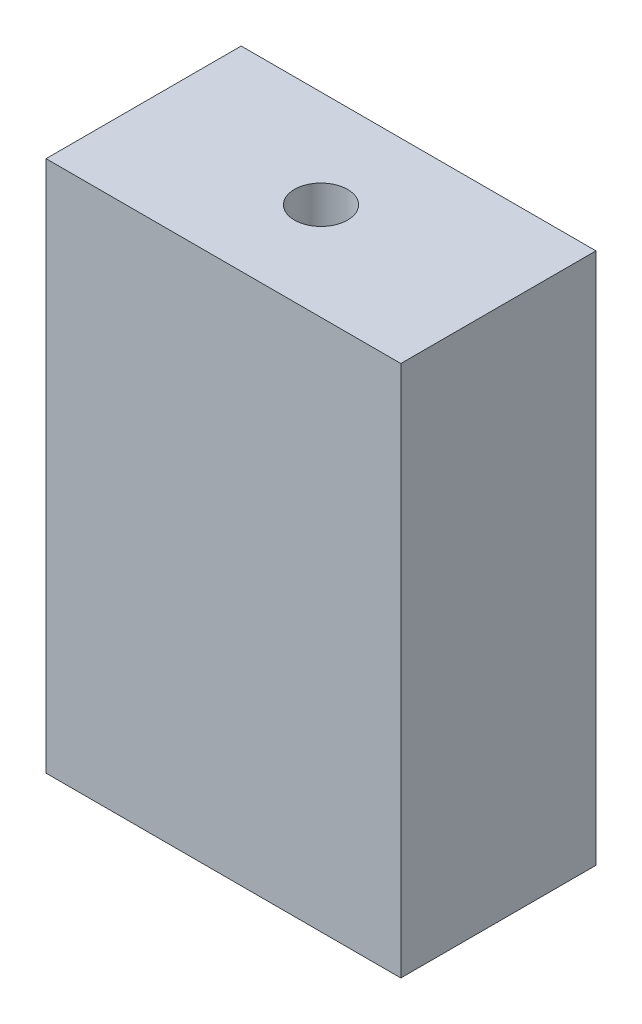
ISO-10303-21;
HEADER;
FILE_DESCRIPTION(('STEP AP214'),'2;1');
FILE_NAME('part.step','',(''),(''),'','','');
FILE_SCHEMA(('AUTOMOTIVE_DESIGN { 1 0 10303 214 1 1 1 1 }'));
ENDSEC;
DATA;
#1=APPLICATION_CONTEXT('core data for automotive mechanical design processes');
#2=APPLICATION_PROTOCOL_DEFINITION('international standard','automotive_design',2000,#1);
#3=PRODUCT_CONTEXT('',#1,'mechanical');
#4=PRODUCT('Part','Part','',(#3));
#5=PRODUCT_RELATED_PRODUCT_CATEGORY('part','',(#4));
#6=PRODUCT_DEFINITION_FORMATION('','',#4);
#7=PRODUCT_DEFINITION_CONTEXT('part definition',#1,'design');
#8=PRODUCT_DEFINITION('design','',#6,#7);
#9=PRODUCT_DEFINITION_SHAPE('','',#8);
#10=(LENGTH_UNIT() NAMED_UNIT(*) SI_UNIT(.MILLI.,.METRE.));
#11=(NAMED_UNIT(*) PLANE_ANGLE_UNIT() SI_UNIT($,.RADIAN.));
#12=(NAMED_UNIT(*) SI_UNIT($,.STERADIAN.) SOLID_ANGLE_UNIT());
#13=UNCERTAINTY_MEASURE_WITH_UNIT(LENGTH_MEASURE(1.E-05),#10,'distance_accuracy_value','');
#14=(GEOMETRIC_REPRESENTATION_CONTEXT(3) GLOBAL_UNCERTAINTY_ASSIGNED_CONTEXT((#13)) GLOBAL_UNIT_ASSIGNED_CONTEXT((#10,
#11,#12)) REPRESENTATION_CONTEXT('',''));
#15=CARTESIAN_POINT('',(0.,0.,0.));
#16=DIRECTION('',(0.,0.,1.));
#17=DIRECTION('',(1.,0.,0.));
#18=AXIS2_PLACEMENT_3D('',#15,#16,#17);
#19=CARTESIAN_POINT('',(0.,0.,-5.));
#20=DIRECTION('',(0.,0.,1.));
#21=DIRECTION('',(1.,0.,0.));
#22=AXIS2_PLACEMENT_3D('',#19,#20,#21);
#23=PLANE('',#22);
#24=DIRECTION('',(0.,-1.,0.));
#25=VECTOR('',#24,1.);
#26=CARTESIAN_POINT('',(-10.,10.,-5.));
#27=LINE('',#26,#25);
#28=CARTESIAN_POINT('',(-10.,20.,-5.));
#29=VERTEX_POINT('',#28);
#30=CARTESIAN_POINT('',(-10.,-10.,-5.));
#31=VERTEX_POINT('',#30);
#32=EDGE_CURVE('E171',#29,#31,#27,.T.);
#33=ORIENTED_EDGE('',*,*,#32,.F.);
#34=DIRECTION('',(-1.,0.,0.));
#35=VECTOR('',#34,1.);
#36=CARTESIAN_POINT('',(10.,20.,-5.));
#37=LINE('',#36,#35);
#38=CARTESIAN_POINT('',(10.,20.,-5.));
#39=VERTEX_POINT('',#38);
#40=EDGE_CURVE('E135',#39,#29,#37,.T.);
#41=ORIENTED_EDGE('',*,*,#40,.F.);
#42=DIRECTION('',(0.,1.,0.));
#43=VECTOR('',#42,1.);
#44=CARTESIAN_POINT('',(10.,10.,-5.));
#45=LINE('',#44,#43);
#46=CARTESIAN_POINT('',(10.,-10.,-5.));
#47=VERTEX_POINT('',#46);
#48=EDGE_CURVE('E179',#47,#39,#45,.T.);
#49=ORIENTED_EDGE('',*,*,#48,.F.);
#50=DIRECTION('',(1.,0.,0.));
#51=VECTOR('',#50,1.);
#52=CARTESIAN_POINT('',(-10.,-10.,-5.));
#53=LINE('',#52,#51);
#54=EDGE_CURVE('E176',#31,#47,#53,.T.);
#55=ORIENTED_EDGE('',*,*,#54,.F.);
#56=EDGE_LOOP('',(#33,#41,#49,#55));
#57=FACE_BOUND('',#56,.T.);
#58=CARTESIAN_POINT('',(0.,0.,-5.));
#59=DIRECTION('',(0.,0.,1.));
#60=DIRECTION('',(1.,0.,0.));
#61=AXIS2_PLACEMENT_3D('',#58,#59,#60);
#62=CIRCLE('',#61,8.);
#63=CARTESIAN_POINT('',(8.,0.,-5.));
#64=VERTEX_POINT('',#63);
#65=EDGE_CURVE('E168',#64,#64,#62,.T.);
#66=ORIENTED_EDGE('',*,*,#65,.T.);
#67=EDGE_LOOP('',(#66));
#68=FACE_BOUND('',#67,.T.);
#69=DIRECTION('',(-1.,0.,0.));
#70=VECTOR('',#69,1.);
#71=CARTESIAN_POINT('',(2.71,14.36,-5.));
#72=LINE('',#71,#70);
#73=CARTESIAN_POINT('',(2.71,14.36,-5.));
#74=VERTEX_POINT('',#73);
#75=CARTESIAN_POINT('',(-2.71,14.36,-5.));
#76=VERTEX_POINT('',#75);
#77=EDGE_CURVE('E105',#74,#76,#72,.T.);
#78=ORIENTED_EDGE('',*,*,#77,.T.);
#79=DIRECTION('',(0.,-1.,0.));
#80=VECTOR('',#79,1.);
#81=CARTESIAN_POINT('',(-2.71,12.,-5.));
#82=LINE('',#81,#80);
#83=CARTESIAN_POINT('',(-2.71,12.,-5.));
#84=VERTEX_POINT('',#83);
#85=EDGE_CURVE('E129',#76,#84,#82,.T.);
#86=ORIENTED_EDGE('',*,*,#85,.T.);
#87=DIRECTION('',(1.,0.,0.));
#88=VECTOR('',#87,1.);
#89=CARTESIAN_POINT('',(2.71,12.,-5.));
#90=LINE('',#89,#88);
#91=CARTESIAN_POINT('',(2.71,12.,-5.));
#92=VERTEX_POINT('',#91);
#93=EDGE_CURVE('E132',#84,#92,#90,.T.);
#94=ORIENTED_EDGE('',*,*,#93,.T.);
#95=DIRECTION('',(0.,1.,0.));
#96=VECTOR('',#95,1.);
#97=CARTESIAN_POINT('',(2.71,12.,-5.));
#98=LINE('',#97,#96);
#99=EDGE_CURVE('E102',#92,#74,#98,.T.);
#100=ORIENTED_EDGE('',*,*,#99,.T.);
#101=EDGE_LOOP('',(#78,#86,#94,#100));
#102=FACE_BOUND('',#101,.T.);
#103=ADVANCED_FACE('F34',(#57,#68,#102),#23,.F.);
#104=CARTESIAN_POINT('',(-10.,10.,-5.));
#105=DIRECTION('',(-1.,0.,0.));
#106=DIRECTION('',(0.,-1.,0.));
#107=AXIS2_PLACEMENT_3D('',#104,#105,#106);
#108=PLANE('',#107);
#109=DIRECTION('',(0.,0.,1.));
#110=VECTOR('',#109,1.);
#111=CARTESIAN_POINT('',(-10.,-10.,-5.));
#112=LINE('',#111,#110);
#113=CARTESIAN_POINT('',(-10.,-10.,6.));
#114=VERTEX_POINT('',#113);
#115=EDGE_CURVE('E38',#31,#114,#112,.T.);
#116=ORIENTED_EDGE('',*,*,#115,.T.);
#117=DIRECTION('',(0.,-1.,0.));
#118=VECTOR('',#117,1.);
#119=CARTESIAN_POINT('',(-10.,10.,6.));
#120=LINE('',#119,#118);
#121=CARTESIAN_POINT('',(-10.,20.,6.));
#122=VERTEX_POINT('',#121);
#123=EDGE_CURVE('E155',#122,#114,#120,.T.);
#124=ORIENTED_EDGE('',*,*,#123,.F.);
#125=DIRECTION('',(0.,0.,1.));
#126=VECTOR('',#125,1.);
#127=CARTESIAN_POINT('',(-10.,20.,-5.));
#128=LINE('',#127,#126);
#129=EDGE_CURVE('E144',#29,#122,#128,.T.);
#130=ORIENTED_EDGE('',*,*,#129,.F.);
#131=ORIENTED_EDGE('',*,*,#32,.T.);
#132=EDGE_LOOP('',(#116,#124,#130,#131));
#133=FACE_BOUND('',#132,.T.);
#134=ADVANCED_FACE('F36',(#133),#108,.T.);
#135=CARTESIAN_POINT('',(10.,10.,-5.));
#136=DIRECTION('',(1.,0.,0.));
#137=DIRECTION('',(0.,0.,-1.));
#138=AXIS2_PLACEMENT_3D('',#135,#136,#137);
#139=PLANE('',#138);
#140=ORIENTED_EDGE('',*,*,#48,.T.);
#141=DIRECTION('',(0.,0.,-1.));
#142=VECTOR('',#141,1.);
#143=CARTESIAN_POINT('',(10.,20.,6.));
#144=LINE('',#143,#142);
#145=CARTESIAN_POINT('',(10.,20.,6.));
#146=VERTEX_POINT('',#145);
#147=EDGE_CURVE('E150',#146,#39,#144,.T.);
#148=ORIENTED_EDGE('',*,*,#147,.F.);
#149=DIRECTION('',(0.,1.,0.));
#150=VECTOR('',#149,1.);
#151=CARTESIAN_POINT('',(10.,-10.,6.));
#152=LINE('',#151,#150);
#153=CARTESIAN_POINT('',(10.,-10.,6.));
#154=VERTEX_POINT('',#153);
#155=EDGE_CURVE('E153',#154,#146,#152,.T.);
#156=ORIENTED_EDGE('',*,*,#155,.F.);
#157=DIRECTION('',(0.,0.,1.));
#158=VECTOR('',#157,1.);
#159=CARTESIAN_POINT('',(10.,-10.,-5.));
#160=LINE('',#159,#158);
#161=EDGE_CURVE('E11',#47,#154,#160,.T.);
#162=ORIENTED_EDGE('',*,*,#161,.F.);
#163=EDGE_LOOP('',(#140,#148,#156,#162));
#164=FACE_BOUND('',#163,.T.);
#165=ADVANCED_FACE('F195',(#164),#139,.T.);
#166=CARTESIAN_POINT('',(-10.,-10.,-5.));
#167=DIRECTION('',(0.,-1.,0.));
#168=DIRECTION('',(0.,0.,-1.));
#169=AXIS2_PLACEMENT_3D('',#166,#167,#168);
#170=PLANE('',#169);
#171=ORIENTED_EDGE('',*,*,#161,.T.);
#172=DIRECTION('',(1.,0.,0.));
#173=VECTOR('',#172,1.);
#174=CARTESIAN_POINT('',(-10.,-10.,6.));
#175=LINE('',#174,#173);
#176=EDGE_CURVE('E158',#114,#154,#175,.T.);
#177=ORIENTED_EDGE('',*,*,#176,.F.);
#178=ORIENTED_EDGE('',*,*,#115,.F.);
#179=ORIENTED_EDGE('',*,*,#54,.T.);
#180=EDGE_LOOP('',(#171,#177,#178,#179));
#181=FACE_BOUND('',#180,.T.);
#182=ADVANCED_FACE('F189',(#181),#170,.T.);
#183=CARTESIAN_POINT('',(0.,0.,-5.));
#184=DIRECTION('',(0.,0.,1.));
#185=DIRECTION('',(1.,0.,0.));
#186=AXIS2_PLACEMENT_3D('',#183,#184,#185);
#187=CYLINDRICAL_SURFACE('',#186,8.);
#188=ORIENTED_EDGE('',*,*,#65,.F.);
#189=EDGE_LOOP('',(#188));
#190=FACE_BOUND('',#189,.T.);
#191=CARTESIAN_POINT('',(0.,0.,0.));
#192=DIRECTION('',(0.,0.,1.));
#193=DIRECTION('',(1.,0.,0.));
#194=AXIS2_PLACEMENT_3D('',#191,#192,#193);
#195=CIRCLE('',#194,8.);
#196=CARTESIAN_POINT('',(8.,0.,0.));
#197=VERTEX_POINT('',#196);
#198=EDGE_CURVE('E167',#197,#197,#195,.T.);
#199=ORIENTED_EDGE('',*,*,#198,.T.);
#200=EDGE_LOOP('',(#199));
#201=FACE_BOUND('',#200,.T.);
#202=ADVANCED_FACE('F202',(#190,#201),#187,.F.);
#203=CARTESIAN_POINT('',(0.,0.,0.));
#204=DIRECTION('',(0.,0.,1.));
#205=DIRECTION('',(1.,0.,0.));
#206=AXIS2_PLACEMENT_3D('',#203,#204,#205);
#207=PLANE('',#206);
#208=CARTESIAN_POINT('',(0.,0.,0.));
#209=DIRECTION('',(0.,0.,1.));
#210=DIRECTION('',(1.,0.,0.));
#211=AXIS2_PLACEMENT_3D('',#208,#209,#210);
#212=CIRCLE('',#211,6.);
#213=CARTESIAN_POINT('',(6.,0.,0.));
#214=VERTEX_POINT('',#213);
#215=EDGE_CURVE('E164',#214,#214,#212,.T.);
#216=ORIENTED_EDGE('',*,*,#215,.T.);
#217=EDGE_LOOP('',(#216));
#218=FACE_BOUND('',#217,.T.);
#219=ORIENTED_EDGE('',*,*,#198,.F.);
#220=EDGE_LOOP('',(#219));
#221=FACE_BOUND('',#220,.T.);
#222=ADVANCED_FACE('F210',(#218,#221),#207,.F.);
#223=CARTESIAN_POINT('',(0.,0.,0.5));
#224=DIRECTION('',(0.,0.,-1.));
#225=DIRECTION('',(-1.,0.,0.));
#226=AXIS2_PLACEMENT_3D('',#223,#224,#225);
#227=CYLINDRICAL_SURFACE('',#226,6.);
#228=CARTESIAN_POINT('',(0.,0.,0.5));
#229=DIRECTION('',(0.,0.,1.));
#230=DIRECTION('',(1.,0.,0.));
#231=AXIS2_PLACEMENT_3D('',#228,#229,#230);
#232=CIRCLE('',#231,6.);
#233=CARTESIAN_POINT('',(6.,0.,0.5));
#234=VERTEX_POINT('',#233);
#235=EDGE_CURVE('E161',#234,#234,#232,.T.);
#236=ORIENTED_EDGE('',*,*,#235,.T.);
#237=EDGE_LOOP('',(#236));
#238=FACE_BOUND('',#237,.T.);
#239=ORIENTED_EDGE('',*,*,#215,.F.);
#240=EDGE_LOOP('',(#239));
#241=FACE_BOUND('',#240,.T.);
#242=ADVANCED_FACE('F214',(#238,#241),#227,.F.);
#243=CARTESIAN_POINT('',(0.,0.,0.5));
#244=DIRECTION('',(0.,0.,1.));
#245=DIRECTION('',(1.,0.,0.));
#246=AXIS2_PLACEMENT_3D('',#243,#244,#245);
#247=PLANE('',#246);
#248=ORIENTED_EDGE('',*,*,#235,.F.);
#249=EDGE_LOOP('',(#248));
#250=FACE_BOUND('',#249,.T.);
#251=ADVANCED_FACE('F218',(#250),#247,.F.);
#252=CARTESIAN_POINT('',(0.,0.,6.));
#253=DIRECTION('',(0.,0.,1.));
#254=DIRECTION('',(1.,0.,0.));
#255=AXIS2_PLACEMENT_3D('',#252,#253,#254);
#256=PLANE('',#255);
#257=ORIENTED_EDGE('',*,*,#155,.T.);
#258=DIRECTION('',(1.,0.,0.));
#259=VECTOR('',#258,1.);
#260=CARTESIAN_POINT('',(-10.,20.,6.));
#261=LINE('',#260,#259);
#262=EDGE_CURVE('E147',#122,#146,#261,.T.);
#263=ORIENTED_EDGE('',*,*,#262,.F.);
#264=ORIENTED_EDGE('',*,*,#123,.T.);
#265=ORIENTED_EDGE('',*,*,#176,.T.);
#266=EDGE_LOOP('',(#257,#263,#264,#265));
#267=FACE_BOUND('',#266,.T.);
#268=ADVANCED_FACE('F188',(#267),#256,.T.);
#269=CARTESIAN_POINT('',(0.,20.,0.));
#270=DIRECTION('',(0.,1.,0.));
#271=DIRECTION('',(0.,0.,1.));
#272=AXIS2_PLACEMENT_3D('',#269,#270,#271);
#273=PLANE('',#272);
#274=CARTESIAN_POINT('',(0.,20.,0.500000000000001));
#275=DIRECTION('',(0.,1.,0.));
#276=DIRECTION('',(0.,0.,1.));
#277=AXIS2_PLACEMENT_3D('',#274,#275,#276);
#278=CIRCLE('',#277,1.5);
#279=CARTESIAN_POINT('',(0.,20.,2.));
#280=VERTEX_POINT('',#279);
#281=EDGE_CURVE('E123',#280,#280,#278,.T.);
#282=ORIENTED_EDGE('',*,*,#281,.F.);
#283=EDGE_LOOP('',(#282));
#284=FACE_BOUND('',#283,.T.);
#285=ORIENTED_EDGE('',*,*,#40,.T.);
#286=ORIENTED_EDGE('',*,*,#129,.T.);
#287=ORIENTED_EDGE('',*,*,#262,.T.);
#288=ORIENTED_EDGE('',*,*,#147,.T.);
#289=EDGE_LOOP('',(#285,#286,#287,#288));
#290=FACE_BOUND('',#289,.T.);
#291=ADVANCED_FACE('F194',(#284,#290),#273,.T.);
#292=CARTESIAN_POINT('',(2.71,14.36,-10.9115141884292));
#293=DIRECTION('',(0.,-1.,0.));
#294=DIRECTION('',(0.,0.,-1.));
#295=AXIS2_PLACEMENT_3D('',#292,#293,#294);
#296=PLANE('',#295);
#297=CARTESIAN_POINT('',(0.,14.36,0.500000000000001));
#298=DIRECTION('',(0.,-1.,0.));
#299=DIRECTION('',(0.,0.,-1.));
#300=AXIS2_PLACEMENT_3D('',#297,#298,#299);
#301=CIRCLE('',#300,1.5);
#302=CARTESIAN_POINT('',(0.,14.36,-0.999999999999999));
#303=VERTEX_POINT('',#302);
#304=EDGE_CURVE('E120',#303,#303,#301,.F.);
#305=ORIENTED_EDGE('',*,*,#304,.T.);
#306=EDGE_LOOP('',(#305));
#307=FACE_BOUND('',#306,.T.);
#308=DIRECTION('',(0.,0.,1.));
#309=VECTOR('',#308,1.);
#310=CARTESIAN_POINT('',(2.71,14.36,-10.9115141884292));
#311=LINE('',#310,#309);
#312=CARTESIAN_POINT('',(2.71,14.36,3.21));
#313=VERTEX_POINT('',#312);
#314=EDGE_CURVE('E49',#74,#313,#311,.T.);
#315=ORIENTED_EDGE('',*,*,#314,.T.);
#316=DIRECTION('',(1.,0.,0.));
#317=VECTOR('',#316,1.);
#318=CARTESIAN_POINT('',(2.71,14.36,3.21));
#319=LINE('',#318,#317);
#320=CARTESIAN_POINT('',(-2.71,14.36,3.21));
#321=VERTEX_POINT('',#320);
#322=EDGE_CURVE('E119',#321,#313,#319,.T.);
#323=ORIENTED_EDGE('',*,*,#322,.F.);
#324=DIRECTION('',(0.,0.,1.));
#325=VECTOR('',#324,1.);
#326=CARTESIAN_POINT('',(-2.71,14.36,-10.9115141884292));
#327=LINE('',#326,#325);
#328=EDGE_CURVE('E137',#76,#321,#327,.T.);
#329=ORIENTED_EDGE('',*,*,#328,.F.);
#330=ORIENTED_EDGE('',*,*,#77,.F.);
#331=EDGE_LOOP('',(#315,#323,#329,#330));
#332=FACE_BOUND('',#331,.T.);
#333=ADVANCED_FACE('F227',(#307,#332),#296,.T.);
#334=CARTESIAN_POINT('',(-2.71,12.,-10.9115141884292));
#335=DIRECTION('',(1.,0.,0.));
#336=DIRECTION('',(0.,1.,0.));
#337=AXIS2_PLACEMENT_3D('',#334,#335,#336);
#338=PLANE('',#337);
#339=ORIENTED_EDGE('',*,*,#328,.T.);
#340=DIRECTION('',(0.,1.,0.));
#341=VECTOR('',#340,1.);
#342=CARTESIAN_POINT('',(-2.71,12.,3.21));
#343=LINE('',#342,#341);
#344=CARTESIAN_POINT('',(-2.71,12.,3.21));
#345=VERTEX_POINT('',#344);
#346=EDGE_CURVE('E115',#345,#321,#343,.T.);
#347=ORIENTED_EDGE('',*,*,#346,.F.);
#348=DIRECTION('',(0.,0.,1.));
#349=VECTOR('',#348,1.);
#350=CARTESIAN_POINT('',(-2.71,12.,-10.9115141884292));
#351=LINE('',#350,#349);
#352=EDGE_CURVE('E106',#84,#345,#351,.T.);
#353=ORIENTED_EDGE('',*,*,#352,.F.);
#354=ORIENTED_EDGE('',*,*,#85,.F.);
#355=EDGE_LOOP('',(#339,#347,#353,#354));
#356=FACE_BOUND('',#355,.T.);
#357=ADVANCED_FACE('F233',(#356),#338,.T.);
#358=CARTESIAN_POINT('',(2.71,12.,-10.9115141884292));
#359=DIRECTION('',(0.,1.,0.));
#360=DIRECTION('',(0.,0.,1.));
#361=AXIS2_PLACEMENT_3D('',#358,#359,#360);
#362=PLANE('',#361);
#363=ORIENTED_EDGE('',*,*,#352,.T.);
#364=DIRECTION('',(-1.,0.,0.));
#365=VECTOR('',#364,1.);
#366=CARTESIAN_POINT('',(2.71,12.,3.21));
#367=LINE('',#366,#365);
#368=CARTESIAN_POINT('',(2.71,12.,3.21));
#369=VERTEX_POINT('',#368);
#370=EDGE_CURVE('E109',#369,#345,#367,.T.);
#371=ORIENTED_EDGE('',*,*,#370,.F.);
#372=DIRECTION('',(0.,0.,1.));
#373=VECTOR('',#372,1.);
#374=CARTESIAN_POINT('',(2.71,12.,-10.9115141884292));
#375=LINE('',#374,#373);
#376=EDGE_CURVE('E95',#92,#369,#375,.T.);
#377=ORIENTED_EDGE('',*,*,#376,.F.);
#378=ORIENTED_EDGE('',*,*,#93,.F.);
#379=EDGE_LOOP('',(#363,#371,#377,#378));
#380=FACE_BOUND('',#379,.T.);
#381=ADVANCED_FACE('F110',(#380),#362,.T.);
#382=CARTESIAN_POINT('',(2.71,12.,-10.9115141884292));
#383=DIRECTION('',(-1.,0.,0.));
#384=DIRECTION('',(0.,-1.,0.));
#385=AXIS2_PLACEMENT_3D('',#382,#383,#384);
#386=PLANE('',#385);
#387=ORIENTED_EDGE('',*,*,#376,.T.);
#388=DIRECTION('',(0.,-1.,0.));
#389=VECTOR('',#388,1.);
#390=CARTESIAN_POINT('',(2.71,12.,3.21));
#391=LINE('',#390,#389);
#392=EDGE_CURVE('E99',#313,#369,#391,.T.);
#393=ORIENTED_EDGE('',*,*,#392,.F.);
#394=ORIENTED_EDGE('',*,*,#314,.F.);
#395=ORIENTED_EDGE('',*,*,#99,.F.);
#396=EDGE_LOOP('',(#387,#393,#394,#395));
#397=FACE_BOUND('',#396,.T.);
#398=ADVANCED_FACE('F97',(#397),#386,.T.);
#399=CARTESIAN_POINT('',(0.,0.,3.21));
#400=DIRECTION('',(0.,0.,1.));
#401=DIRECTION('',(1.,0.,0.));
#402=AXIS2_PLACEMENT_3D('',#399,#400,#401);
#403=PLANE('',#402);
#404=ORIENTED_EDGE('',*,*,#392,.T.);
#405=ORIENTED_EDGE('',*,*,#370,.T.);
#406=ORIENTED_EDGE('',*,*,#346,.T.);
#407=ORIENTED_EDGE('',*,*,#322,.T.);
#408=EDGE_LOOP('',(#404,#405,#406,#407));
#409=FACE_BOUND('',#408,.T.);
#410=ADVANCED_FACE('F117',(#409),#403,.F.);
#411=CARTESIAN_POINT('',(0.,10.1173593128807,0.500000000000001));
#412=DIRECTION('',(0.,1.,0.));
#413=DIRECTION('',(0.,0.,1.));
#414=AXIS2_PLACEMENT_3D('',#411,#412,#413);
#415=CYLINDRICAL_SURFACE('',#414,1.5);
#416=ORIENTED_EDGE('',*,*,#281,.T.);
#417=EDGE_LOOP('',(#416));
#418=FACE_BOUND('',#417,.T.);
#419=ORIENTED_EDGE('',*,*,#304,.F.);
#420=EDGE_LOOP('',(#419));
#421=FACE_BOUND('',#420,.T.);
#422=ADVANCED_FACE('F242',(#418,#421),#415,.F.);
#423=CLOSED_SHELL('',(#103,#134,#165,#182,#202,#222,#242,#251,#268,#291,#333,#357,#381,#398,
#410,#422));
#424=MANIFOLD_SOLID_BREP('B2',#423);
#425=ADVANCED_BREP_SHAPE_REPRESENTATION('',(#18,#424),#14);
#426=SHAPE_DEFINITION_REPRESENTATION(#9,#425);
ENDSEC;
END-ISO-10303-21;
